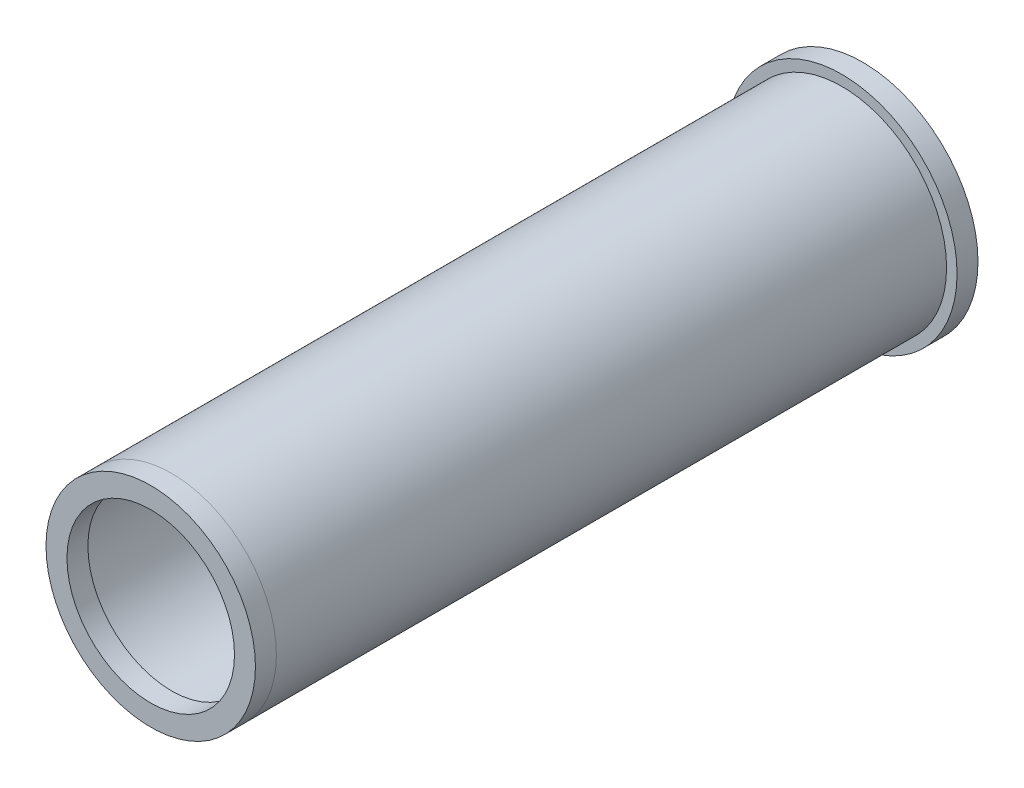
ISO-10303-21;
HEADER;
FILE_DESCRIPTION(('STEP AP214'),'2;1');
FILE_NAME('part.step','',(''),(''),'','','');
FILE_SCHEMA(('AUTOMOTIVE_DESIGN { 1 0 10303 214 1 1 1 1 }'));
ENDSEC;
DATA;
#1=APPLICATION_CONTEXT('core data for automotive mechanical design processes');
#2=APPLICATION_PROTOCOL_DEFINITION('international standard','automotive_design',2000,#1);
#3=PRODUCT_CONTEXT('',#1,'mechanical');
#4=PRODUCT('Part','Part','',(#3));
#5=PRODUCT_RELATED_PRODUCT_CATEGORY('part','',(#4));
#6=PRODUCT_DEFINITION_FORMATION('','',#4);
#7=PRODUCT_DEFINITION_CONTEXT('part definition',#1,'design');
#8=PRODUCT_DEFINITION('design','',#6,#7);
#9=PRODUCT_DEFINITION_SHAPE('','',#8);
#10=(LENGTH_UNIT() NAMED_UNIT(*) SI_UNIT(.MILLI.,.METRE.));
#11=(NAMED_UNIT(*) PLANE_ANGLE_UNIT() SI_UNIT($,.RADIAN.));
#12=(NAMED_UNIT(*) SI_UNIT($,.STERADIAN.) SOLID_ANGLE_UNIT());
#13=UNCERTAINTY_MEASURE_WITH_UNIT(LENGTH_MEASURE(1.E-05),#10,'distance_accuracy_value','');
#14=(GEOMETRIC_REPRESENTATION_CONTEXT(3) GLOBAL_UNCERTAINTY_ASSIGNED_CONTEXT((#13)) GLOBAL_UNIT_ASSIGNED_CONTEXT((#10,
#11,#12)) REPRESENTATION_CONTEXT('',''));
#15=CARTESIAN_POINT('',(0.,0.,0.));
#16=DIRECTION('',(0.,0.,1.));
#17=DIRECTION('',(1.,0.,0.));
#18=AXIS2_PLACEMENT_3D('',#15,#16,#17);
#19=CARTESIAN_POINT('',(0.,0.,419.1));
#20=DIRECTION('',(0.,0.,1.));
#21=DIRECTION('',(1.,0.,0.));
#22=AXIS2_PLACEMENT_3D('',#19,#20,#21);
#23=PLANE('',#22);
#24=CARTESIAN_POINT('',(0.,0.,419.1));
#25=DIRECTION('',(0.,0.,1.));
#26=DIRECTION('',(1.,0.,0.));
#27=AXIS2_PLACEMENT_3D('',#24,#25,#26);
#28=CIRCLE('',#27,63.5);
#29=CARTESIAN_POINT('',(63.5,0.,419.1));
#30=VERTEX_POINT('',#29);
#31=EDGE_CURVE('E11',#30,#30,#28,.T.);
#32=ORIENTED_EDGE('',*,*,#31,.T.);
#33=EDGE_LOOP('',(#32));
#34=FACE_BOUND('',#33,.T.);
#35=CARTESIAN_POINT('',(0.,0.,419.1));
#36=DIRECTION('',(0.,0.,1.));
#37=DIRECTION('',(1.,0.,0.));
#38=AXIS2_PLACEMENT_3D('',#35,#36,#37);
#39=CIRCLE('',#38,50.8);
#40=CARTESIAN_POINT('',(50.8,0.,419.1));
#41=VERTEX_POINT('',#40);
#42=EDGE_CURVE('E56',#41,#41,#39,.T.);
#43=ORIENTED_EDGE('',*,*,#42,.F.);
#44=EDGE_LOOP('',(#43));
#45=FACE_BOUND('',#44,.T.);
#46=ADVANCED_FACE('F45',(#34,#45),#23,.T.);
#47=CARTESIAN_POINT('',(0.,0.,406.4));
#48=DIRECTION('',(0.,0.,1.));
#49=DIRECTION('',(1.,0.,0.));
#50=AXIS2_PLACEMENT_3D('',#47,#48,#49);
#51=PLANE('',#50);
#52=CARTESIAN_POINT('',(0.,0.,406.4));
#53=DIRECTION('',(0.,0.,1.));
#54=DIRECTION('',(1.,0.,0.));
#55=AXIS2_PLACEMENT_3D('',#52,#53,#54);
#56=CIRCLE('',#55,63.5);
#57=CARTESIAN_POINT('',(63.5,0.,406.4));
#58=VERTEX_POINT('',#57);
#59=EDGE_CURVE('E49',#58,#58,#56,.T.);
#60=ORIENTED_EDGE('',*,*,#59,.F.);
#61=EDGE_LOOP('',(#60));
#62=FACE_BOUND('',#61,.T.);
#63=CARTESIAN_POINT('',(0.,0.,406.4));
#64=DIRECTION('',(0.,0.,1.));
#65=DIRECTION('',(1.,0.,0.));
#66=AXIS2_PLACEMENT_3D('',#63,#64,#65);
#67=CIRCLE('',#66,50.8);
#68=CARTESIAN_POINT('',(50.8,0.,406.4));
#69=VERTEX_POINT('',#68);
#70=EDGE_CURVE('E58',#69,#69,#67,.T.);
#71=ORIENTED_EDGE('',*,*,#70,.T.);
#72=EDGE_LOOP('',(#71));
#73=FACE_BOUND('',#72,.T.);
#74=ADVANCED_FACE('F68',(#62,#73),#51,.F.);
#75=CARTESIAN_POINT('',(0.,0.,419.1));
#76=DIRECTION('',(0.,0.,-1.));
#77=DIRECTION('',(-1.,0.,0.));
#78=AXIS2_PLACEMENT_3D('',#75,#76,#77);
#79=CYLINDRICAL_SURFACE('',#78,63.5);
#80=ORIENTED_EDGE('',*,*,#31,.F.);
#81=EDGE_LOOP('',(#80));
#82=FACE_BOUND('',#81,.T.);
#83=ORIENTED_EDGE('',*,*,#59,.T.);
#84=EDGE_LOOP('',(#83));
#85=FACE_BOUND('',#84,.T.);
#86=ADVANCED_FACE('F47',(#82,#85),#79,.T.);
#87=CARTESIAN_POINT('',(0.,0.,419.1));
#88=DIRECTION('',(0.,0.,-1.));
#89=DIRECTION('',(-1.,0.,0.));
#90=AXIS2_PLACEMENT_3D('',#87,#88,#89);
#91=CYLINDRICAL_SURFACE('',#90,50.8);
#92=ORIENTED_EDGE('',*,*,#42,.T.);
#93=EDGE_LOOP('',(#92));
#94=FACE_BOUND('',#93,.T.);
#95=ORIENTED_EDGE('',*,*,#70,.F.);
#96=EDGE_LOOP('',(#95));
#97=FACE_BOUND('',#96,.T.);
#98=ADVANCED_FACE('F64',(#94,#97),#91,.F.);
#99=CLOSED_SHELL('',(#46,#74,#86,#98));
#100=MANIFOLD_SOLID_BREP('B2',#99);
#101=CARTESIAN_POINT('',(0.,0.,-12.7));
#102=DIRECTION('',(0.,0.,1.));
#103=DIRECTION('',(1.,0.,0.));
#104=AXIS2_PLACEMENT_3D('',#101,#102,#103);
#105=CYLINDRICAL_SURFACE('',#104,69.85);
#106=CARTESIAN_POINT('',(0.,0.,-12.7));
#107=DIRECTION('',(0.,0.,1.));
#108=DIRECTION('',(1.,0.,0.));
#109=AXIS2_PLACEMENT_3D('',#106,#107,#108);
#110=CIRCLE('',#109,69.85);
#111=CARTESIAN_POINT('',(69.85,0.,-12.7));
#112=VERTEX_POINT('',#111);
#113=EDGE_CURVE('E122',#112,#112,#110,.T.);
#114=ORIENTED_EDGE('',*,*,#113,.T.);
#115=EDGE_LOOP('',(#114));
#116=FACE_BOUND('',#115,.T.);
#117=CARTESIAN_POINT('',(0.,0.,0.));
#118=DIRECTION('',(0.,0.,1.));
#119=DIRECTION('',(1.,0.,0.));
#120=AXIS2_PLACEMENT_3D('',#117,#118,#119);
#121=CIRCLE('',#120,69.85);
#122=CARTESIAN_POINT('',(69.85,0.,0.));
#123=VERTEX_POINT('',#122);
#124=EDGE_CURVE('E118',#123,#123,#121,.T.);
#125=ORIENTED_EDGE('',*,*,#124,.F.);
#126=EDGE_LOOP('',(#125));
#127=FACE_BOUND('',#126,.T.);
#128=ADVANCED_FACE('F115',(#116,#127),#105,.T.);
#129=CARTESIAN_POINT('',(0.,0.,-12.7));
#130=DIRECTION('',(0.,0.,1.));
#131=DIRECTION('',(1.,0.,0.));
#132=AXIS2_PLACEMENT_3D('',#129,#130,#131);
#133=CYLINDRICAL_SURFACE('',#132,57.15);
#134=CARTESIAN_POINT('',(0.,0.,-12.7));
#135=DIRECTION('',(0.,0.,1.));
#136=DIRECTION('',(1.,0.,0.));
#137=AXIS2_PLACEMENT_3D('',#134,#135,#136);
#138=CIRCLE('',#137,57.15);
#139=CARTESIAN_POINT('',(57.15,0.,-12.7));
#140=VERTEX_POINT('',#139);
#141=EDGE_CURVE('E44',#140,#140,#138,.T.);
#142=ORIENTED_EDGE('',*,*,#141,.F.);
#143=EDGE_LOOP('',(#142));
#144=FACE_BOUND('',#143,.T.);
#145=CARTESIAN_POINT('',(0.,0.,406.4));
#146=DIRECTION('',(0.,0.,1.));
#147=DIRECTION('',(1.,0.,0.));
#148=AXIS2_PLACEMENT_3D('',#145,#146,#147);
#149=CIRCLE('',#148,57.15);
#150=CARTESIAN_POINT('',(57.15,0.,406.4));
#151=VERTEX_POINT('',#150);
#152=EDGE_CURVE('E131',#151,#151,#149,.T.);
#153=ORIENTED_EDGE('',*,*,#152,.T.);
#154=EDGE_LOOP('',(#153));
#155=FACE_BOUND('',#154,.T.);
#156=ADVANCED_FACE('F138',(#144,#155),#133,.F.);
#157=CARTESIAN_POINT('',(0.,0.,-12.7));
#158=DIRECTION('',(0.,0.,1.));
#159=DIRECTION('',(1.,0.,0.));
#160=AXIS2_PLACEMENT_3D('',#157,#158,#159);
#161=PLANE('',#160);
#162=ORIENTED_EDGE('',*,*,#113,.F.);
#163=EDGE_LOOP('',(#162));
#164=FACE_BOUND('',#163,.T.);
#165=ORIENTED_EDGE('',*,*,#141,.T.);
#166=EDGE_LOOP('',(#165));
#167=FACE_BOUND('',#166,.T.);
#168=ADVANCED_FACE('F155',(#164,#167),#161,.F.);
#169=CARTESIAN_POINT('',(0.,0.,0.));
#170=DIRECTION('',(0.,0.,1.));
#171=DIRECTION('',(1.,0.,0.));
#172=AXIS2_PLACEMENT_3D('',#169,#170,#171);
#173=PLANE('',#172);
#174=CARTESIAN_POINT('',(0.,0.,0.));
#175=DIRECTION('',(0.,0.,1.));
#176=DIRECTION('',(1.,0.,0.));
#177=AXIS2_PLACEMENT_3D('',#174,#175,#176);
#178=CIRCLE('',#177,63.5);
#179=CARTESIAN_POINT('',(63.5,0.,0.));
#180=VERTEX_POINT('',#179);
#181=EDGE_CURVE('E128',#180,#180,#178,.T.);
#182=ORIENTED_EDGE('',*,*,#181,.F.);
#183=EDGE_LOOP('',(#182));
#184=FACE_BOUND('',#183,.T.);
#185=ORIENTED_EDGE('',*,*,#124,.T.);
#186=EDGE_LOOP('',(#185));
#187=FACE_BOUND('',#186,.T.);
#188=ADVANCED_FACE('F149',(#184,#187),#173,.T.);
#189=CARTESIAN_POINT('',(0.,0.,406.4));
#190=DIRECTION('',(0.,0.,-1.));
#191=DIRECTION('',(-1.,0.,0.));
#192=AXIS2_PLACEMENT_3D('',#189,#190,#191);
#193=CYLINDRICAL_SURFACE('',#192,63.5);
#194=CARTESIAN_POINT('',(0.,0.,406.4));
#195=DIRECTION('',(0.,0.,1.));
#196=DIRECTION('',(1.,0.,0.));
#197=AXIS2_PLACEMENT_3D('',#194,#195,#196);
#198=CIRCLE('',#197,63.5);
#199=CARTESIAN_POINT('',(63.5,0.,406.4));
#200=VERTEX_POINT('',#199);
#201=EDGE_CURVE('E132',#200,#200,#198,.T.);
#202=ORIENTED_EDGE('',*,*,#201,.F.);
#203=EDGE_LOOP('',(#202));
#204=FACE_BOUND('',#203,.T.);
#205=ORIENTED_EDGE('',*,*,#181,.T.);
#206=EDGE_LOOP('',(#205));
#207=FACE_BOUND('',#206,.T.);
#208=ADVANCED_FACE('F143',(#204,#207),#193,.T.);
#209=CARTESIAN_POINT('',(0.,0.,406.4));
#210=DIRECTION('',(0.,0.,1.));
#211=DIRECTION('',(1.,0.,0.));
#212=AXIS2_PLACEMENT_3D('',#209,#210,#211);
#213=PLANE('',#212);
#214=ORIENTED_EDGE('',*,*,#152,.F.);
#215=EDGE_LOOP('',(#214));
#216=FACE_BOUND('',#215,.T.);
#217=ORIENTED_EDGE('',*,*,#201,.T.);
#218=EDGE_LOOP('',(#217));
#219=FACE_BOUND('',#218,.T.);
#220=ADVANCED_FACE('F140',(#216,#219),#213,.T.);
#221=CLOSED_SHELL('',(#128,#156,#168,#188,#208,#220));
#222=MANIFOLD_SOLID_BREP('B6',#221);
#223=ADVANCED_BREP_SHAPE_REPRESENTATION('',(#18,#100,#222),#14);
#224=SHAPE_DEFINITION_REPRESENTATION(#9,#223);
ENDSEC;
END-ISO-10303-21;
